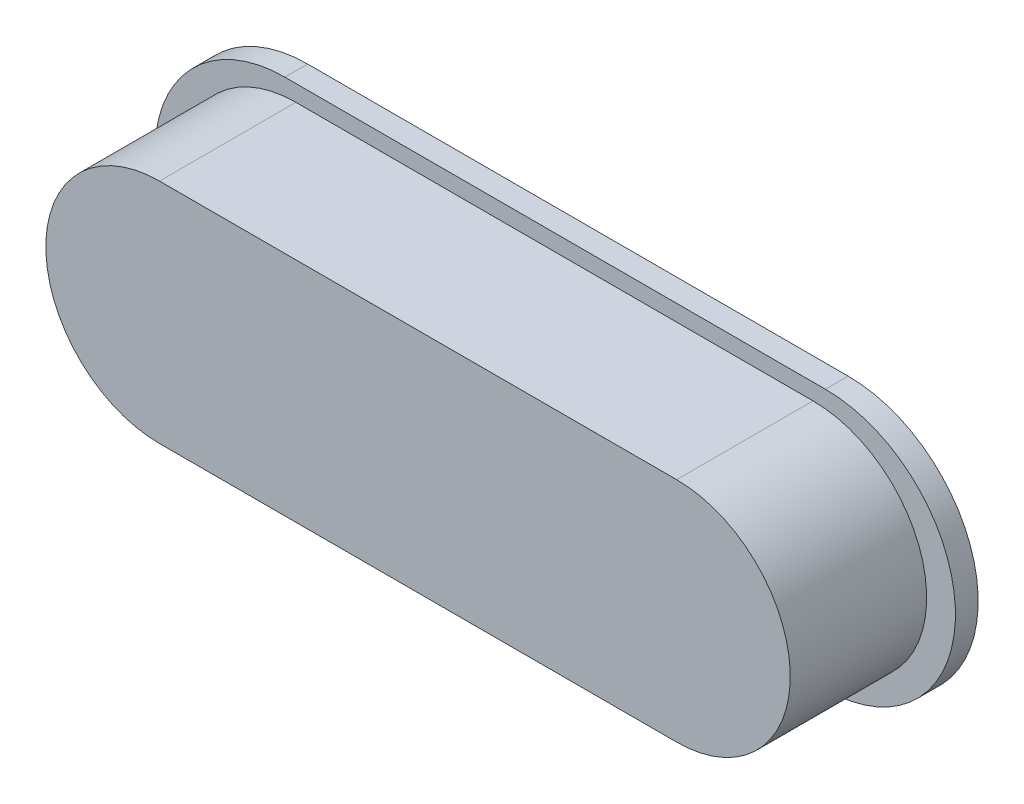
ISO-10303-21;
HEADER;
FILE_DESCRIPTION(('STEP AP214'),'2;1');
FILE_NAME('part.step','',(''),(''),'','','');
FILE_SCHEMA(('AUTOMOTIVE_DESIGN { 1 0 10303 214 1 1 1 1 }'));
ENDSEC;
DATA;
#1=APPLICATION_CONTEXT('core data for automotive mechanical design processes');
#2=APPLICATION_PROTOCOL_DEFINITION('international standard','automotive_design',2000,#1);
#3=PRODUCT_CONTEXT('',#1,'mechanical');
#4=PRODUCT('Part','Part','',(#3));
#5=PRODUCT_RELATED_PRODUCT_CATEGORY('part','',(#4));
#6=PRODUCT_DEFINITION_FORMATION('','',#4);
#7=PRODUCT_DEFINITION_CONTEXT('part definition',#1,'design');
#8=PRODUCT_DEFINITION('design','',#6,#7);
#9=PRODUCT_DEFINITION_SHAPE('','',#8);
#10=(LENGTH_UNIT() NAMED_UNIT(*) SI_UNIT(.MILLI.,.METRE.));
#11=(NAMED_UNIT(*) PLANE_ANGLE_UNIT() SI_UNIT($,.RADIAN.));
#12=(NAMED_UNIT(*) SI_UNIT($,.STERADIAN.) SOLID_ANGLE_UNIT());
#13=UNCERTAINTY_MEASURE_WITH_UNIT(LENGTH_MEASURE(1.E-05),#10,'distance_accuracy_value','');
#14=(GEOMETRIC_REPRESENTATION_CONTEXT(3) GLOBAL_UNCERTAINTY_ASSIGNED_CONTEXT((#13)) GLOBAL_UNIT_ASSIGNED_CONTEXT((#10,
#11,#12)) REPRESENTATION_CONTEXT('',''));
#15=CARTESIAN_POINT('',(0.,0.,0.));
#16=DIRECTION('',(0.,0.,1.));
#17=DIRECTION('',(1.,0.,0.));
#18=AXIS2_PLACEMENT_3D('',#15,#16,#17);
#19=CARTESIAN_POINT('',(-22.75,11.4348279403043,-1.99999999999999));
#20=DIRECTION('',(0.,1.,0.));
#21=DIRECTION('',(-1.,0.,0.));
#22=AXIS2_PLACEMENT_3D('',#19,#20,#21);
#23=PLANE('',#22);
#24=DIRECTION('',(-1.,0.,0.));
#25=VECTOR('',#24,1.);
#26=CARTESIAN_POINT('',(-22.75,11.4348279403043,0.));
#27=LINE('',#26,#25);
#28=CARTESIAN_POINT('',(23.8475102992996,11.4348279403043,0.));
#29=VERTEX_POINT('',#28);
#30=CARTESIAN_POINT('',(-23.7170580444005,11.4348279403043,0.));
#31=VERTEX_POINT('',#30);
#32=EDGE_CURVE('E145',#29,#31,#27,.T.);
#33=ORIENTED_EDGE('',*,*,#32,.F.);
#34=DIRECTION('',(0.,0.,1.));
#35=VECTOR('',#34,1.);
#36=CARTESIAN_POINT('',(23.8475102992996,11.4348279403043,-1.99999999999999));
#37=LINE('',#36,#35);
#38=CARTESIAN_POINT('',(23.8475102992996,11.4348279403043,-1.99999999999999));
#39=VERTEX_POINT('',#38);
#40=EDGE_CURVE('E12',#39,#29,#37,.T.);
#41=ORIENTED_EDGE('',*,*,#40,.F.);
#42=DIRECTION('',(-1.,0.,0.));
#43=VECTOR('',#42,1.);
#44=CARTESIAN_POINT('',(-22.75,11.4348279403043,-1.99999999999999));
#45=LINE('',#44,#43);
#46=CARTESIAN_POINT('',(-23.7170580444005,11.4348279403043,-1.99999999999999));
#47=VERTEX_POINT('',#46);
#48=EDGE_CURVE('E149',#39,#47,#45,.T.);
#49=ORIENTED_EDGE('',*,*,#48,.T.);
#50=DIRECTION('',(0.,0.,1.));
#51=VECTOR('',#50,1.);
#52=CARTESIAN_POINT('',(-23.7170580444005,11.4348279403043,-1.99999999999999));
#53=LINE('',#52,#51);
#54=EDGE_CURVE('E50',#47,#31,#53,.T.);
#55=ORIENTED_EDGE('',*,*,#54,.T.);
#56=EDGE_LOOP('',(#33,#41,#49,#55));
#57=FACE_BOUND('',#56,.T.);
#58=ADVANCED_FACE('F47',(#57),#23,.T.);
#59=CARTESIAN_POINT('',(23.8475102992996,0.,-1.99999999999999));
#60=DIRECTION('',(0.,0.,1.));
#61=DIRECTION('',(1.,0.,0.));
#62=AXIS2_PLACEMENT_3D('',#59,#60,#61);
#63=CYLINDRICAL_SURFACE('',#62,11.4348279403043);
#64=CARTESIAN_POINT('',(23.8475102992996,0.,0.));
#65=DIRECTION('',(0.,0.,1.));
#66=DIRECTION('',(1.,0.,0.));
#67=AXIS2_PLACEMENT_3D('',#64,#65,#66);
#68=CIRCLE('',#67,11.4348279403043);
#69=CARTESIAN_POINT('',(23.8475102992996,-11.4348279403043,0.));
#70=VERTEX_POINT('',#69);
#71=EDGE_CURVE('E153',#70,#29,#68,.T.);
#72=ORIENTED_EDGE('',*,*,#71,.F.);
#73=DIRECTION('',(0.,0.,1.));
#74=VECTOR('',#73,1.);
#75=CARTESIAN_POINT('',(23.8475102992996,-11.4348279403043,-1.99999999999999));
#76=LINE('',#75,#74);
#77=CARTESIAN_POINT('',(23.8475102992996,-11.4348279403043,-1.99999999999999));
#78=VERTEX_POINT('',#77);
#79=EDGE_CURVE('E55',#78,#70,#76,.T.);
#80=ORIENTED_EDGE('',*,*,#79,.F.);
#81=CARTESIAN_POINT('',(23.8475102992996,0.,-1.99999999999999));
#82=DIRECTION('',(0.,0.,1.));
#83=DIRECTION('',(1.,0.,0.));
#84=AXIS2_PLACEMENT_3D('',#81,#82,#83);
#85=CIRCLE('',#84,11.4348279403043);
#86=EDGE_CURVE('E159',#78,#39,#85,.T.);
#87=ORIENTED_EDGE('',*,*,#86,.T.);
#88=ORIENTED_EDGE('',*,*,#40,.T.);
#89=EDGE_LOOP('',(#72,#80,#87,#88));
#90=FACE_BOUND('',#89,.T.);
#91=ADVANCED_FACE('F185',(#90),#63,.T.);
#92=CARTESIAN_POINT('',(-22.75,-11.4348279403043,-1.99999999999999));
#93=DIRECTION('',(0.,-1.,0.));
#94=DIRECTION('',(1.,0.,0.));
#95=AXIS2_PLACEMENT_3D('',#92,#93,#94);
#96=PLANE('',#95);
#97=DIRECTION('',(1.,0.,0.));
#98=VECTOR('',#97,1.);
#99=CARTESIAN_POINT('',(-22.75,-11.4348279403043,0.));
#100=LINE('',#99,#98);
#101=CARTESIAN_POINT('',(-23.7170580444005,-11.4348279403043,0.));
#102=VERTEX_POINT('',#101);
#103=EDGE_CURVE('E167',#102,#70,#100,.T.);
#104=ORIENTED_EDGE('',*,*,#103,.F.);
#105=DIRECTION('',(0.,0.,1.));
#106=VECTOR('',#105,1.);
#107=CARTESIAN_POINT('',(-23.7170580444005,-11.4348279403043,-1.99999999999999));
#108=LINE('',#107,#106);
#109=CARTESIAN_POINT('',(-23.7170580444005,-11.4348279403043,-1.99999999999999));
#110=VERTEX_POINT('',#109);
#111=EDGE_CURVE('E172',#110,#102,#108,.T.);
#112=ORIENTED_EDGE('',*,*,#111,.F.);
#113=DIRECTION('',(1.,0.,0.));
#114=VECTOR('',#113,1.);
#115=CARTESIAN_POINT('',(-22.75,-11.4348279403043,-1.99999999999999));
#116=LINE('',#115,#114);
#117=EDGE_CURVE('E156',#110,#78,#116,.T.);
#118=ORIENTED_EDGE('',*,*,#117,.T.);
#119=ORIENTED_EDGE('',*,*,#79,.T.);
#120=EDGE_LOOP('',(#104,#112,#118,#119));
#121=FACE_BOUND('',#120,.T.);
#122=ADVANCED_FACE('F189',(#121),#96,.T.);
#123=CARTESIAN_POINT('',(-23.7170580444005,0.,-1.99999999999999));
#124=DIRECTION('',(0.,0.,1.));
#125=DIRECTION('',(1.,0.,0.));
#126=AXIS2_PLACEMENT_3D('',#123,#124,#125);
#127=CYLINDRICAL_SURFACE('',#126,11.4348279403043);
#128=CARTESIAN_POINT('',(-23.7170580444005,0.,0.));
#129=DIRECTION('',(0.,0.,1.));
#130=DIRECTION('',(1.,0.,0.));
#131=AXIS2_PLACEMENT_3D('',#128,#129,#130);
#132=CIRCLE('',#131,11.4348279403043);
#133=EDGE_CURVE('E164',#31,#102,#132,.T.);
#134=ORIENTED_EDGE('',*,*,#133,.F.);
#135=ORIENTED_EDGE('',*,*,#54,.F.);
#136=CARTESIAN_POINT('',(-23.7170580444005,0.,-1.99999999999999));
#137=DIRECTION('',(0.,0.,1.));
#138=DIRECTION('',(1.,0.,0.));
#139=AXIS2_PLACEMENT_3D('',#136,#137,#138);
#140=CIRCLE('',#139,11.4348279403043);
#141=EDGE_CURVE('E152',#47,#110,#140,.T.);
#142=ORIENTED_EDGE('',*,*,#141,.T.);
#143=ORIENTED_EDGE('',*,*,#111,.T.);
#144=EDGE_LOOP('',(#134,#135,#142,#143));
#145=FACE_BOUND('',#144,.T.);
#146=ADVANCED_FACE('F180',(#145),#127,.T.);
#147=CARTESIAN_POINT('',(-23.7170580444005,0.,-1.99999999999999));
#148=DIRECTION('',(0.,0.,1.));
#149=DIRECTION('',(1.,0.,0.));
#150=AXIS2_PLACEMENT_3D('',#147,#148,#149);
#151=PLANE('',#150);
#152=CARTESIAN_POINT('',(23.5,0.,-1.99999999999999));
#153=DIRECTION('',(0.,0.,1.));
#154=DIRECTION('',(1.,0.,0.));
#155=AXIS2_PLACEMENT_3D('',#152,#153,#154);
#156=CIRCLE('',#155,8.);
#157=CARTESIAN_POINT('',(23.5,-7.99999999999999,-1.99999999999999));
#158=VERTEX_POINT('',#157);
#159=CARTESIAN_POINT('',(23.5,8.00000000000001,-1.99999999999999));
#160=VERTEX_POINT('',#159);
#161=EDGE_CURVE('E120',#158,#160,#156,.T.);
#162=ORIENTED_EDGE('',*,*,#161,.T.);
#163=DIRECTION('',(-1.,0.,0.));
#164=VECTOR('',#163,1.);
#165=CARTESIAN_POINT('',(-22.75,8.,-1.99999999999999));
#166=LINE('',#165,#164);
#167=CARTESIAN_POINT('',(-22.75,8.,-1.99999999999999));
#168=VERTEX_POINT('',#167);
#169=EDGE_CURVE('E114',#160,#168,#166,.T.);
#170=ORIENTED_EDGE('',*,*,#169,.T.);
#171=CARTESIAN_POINT('',(-22.75,0.,-1.99999999999999));
#172=DIRECTION('',(0.,0.,1.));
#173=DIRECTION('',(1.,0.,0.));
#174=AXIS2_PLACEMENT_3D('',#171,#172,#173);
#175=CIRCLE('',#174,8.);
#176=CARTESIAN_POINT('',(-22.75,-8.,-1.99999999999999));
#177=VERTEX_POINT('',#176);
#178=EDGE_CURVE('E123',#168,#177,#175,.T.);
#179=ORIENTED_EDGE('',*,*,#178,.T.);
#180=DIRECTION('',(1.,0.,0.));
#181=VECTOR('',#180,1.);
#182=CARTESIAN_POINT('',(-22.75,-8.,-1.99999999999999));
#183=LINE('',#182,#181);
#184=EDGE_CURVE('E63',#177,#158,#183,.T.);
#185=ORIENTED_EDGE('',*,*,#184,.T.);
#186=EDGE_LOOP('',(#162,#170,#179,#185));
#187=FACE_BOUND('',#186,.T.);
#188=ORIENTED_EDGE('',*,*,#48,.F.);
#189=ORIENTED_EDGE('',*,*,#86,.F.);
#190=ORIENTED_EDGE('',*,*,#117,.F.);
#191=ORIENTED_EDGE('',*,*,#141,.F.);
#192=EDGE_LOOP('',(#188,#189,#190,#191));
#193=FACE_BOUND('',#192,.T.);
#194=ADVANCED_FACE('F127',(#187,#193),#151,.F.);
#195=CARTESIAN_POINT('',(-23.7170580444005,0.,0.));
#196=DIRECTION('',(0.,0.,1.));
#197=DIRECTION('',(1.,0.,0.));
#198=AXIS2_PLACEMENT_3D('',#195,#196,#197);
#199=PLANE('',#198);
#200=DIRECTION('',(-1.,0.,0.));
#201=VECTOR('',#200,1.);
#202=CARTESIAN_POINT('',(-22.75,8.,0.));
#203=LINE('',#202,#201);
#204=CARTESIAN_POINT('',(23.5,8.00000000000001,0.));
#205=VERTEX_POINT('',#204);
#206=CARTESIAN_POINT('',(-22.75,8.,0.));
#207=VERTEX_POINT('',#206);
#208=EDGE_CURVE('E71',#205,#207,#203,.T.);
#209=ORIENTED_EDGE('',*,*,#208,.F.);
#210=CARTESIAN_POINT('',(23.5,0.,0.));
#211=DIRECTION('',(0.,0.,1.));
#212=DIRECTION('',(1.,0.,0.));
#213=AXIS2_PLACEMENT_3D('',#210,#211,#212);
#214=CIRCLE('',#213,8.);
#215=CARTESIAN_POINT('',(23.5,-7.99999999999999,0.));
#216=VERTEX_POINT('',#215);
#217=EDGE_CURVE('E130',#216,#205,#214,.T.);
#218=ORIENTED_EDGE('',*,*,#217,.F.);
#219=DIRECTION('',(1.,0.,0.));
#220=VECTOR('',#219,1.);
#221=CARTESIAN_POINT('',(-22.75,-8.,0.));
#222=LINE('',#221,#220);
#223=CARTESIAN_POINT('',(-22.75,-8.,0.));
#224=VERTEX_POINT('',#223);
#225=EDGE_CURVE('E133',#224,#216,#222,.T.);
#226=ORIENTED_EDGE('',*,*,#225,.F.);
#227=CARTESIAN_POINT('',(-22.75,0.,0.));
#228=DIRECTION('',(0.,0.,1.));
#229=DIRECTION('',(1.,0.,0.));
#230=AXIS2_PLACEMENT_3D('',#227,#228,#229);
#231=CIRCLE('',#230,8.);
#232=EDGE_CURVE('E139',#207,#224,#231,.T.);
#233=ORIENTED_EDGE('',*,*,#232,.F.);
#234=EDGE_LOOP('',(#209,#218,#226,#233));
#235=FACE_BOUND('',#234,.T.);
#236=ORIENTED_EDGE('',*,*,#32,.T.);
#237=ORIENTED_EDGE('',*,*,#133,.T.);
#238=ORIENTED_EDGE('',*,*,#103,.T.);
#239=ORIENTED_EDGE('',*,*,#71,.T.);
#240=EDGE_LOOP('',(#236,#237,#238,#239));
#241=FACE_BOUND('',#240,.T.);
#242=ADVANCED_FACE('F182',(#235,#241),#199,.T.);
#243=CARTESIAN_POINT('',(-22.75,8.,-1.99999999999999));
#244=DIRECTION('',(0.,1.,0.));
#245=DIRECTION('',(0.,0.,1.));
#246=AXIS2_PLACEMENT_3D('',#243,#244,#245);
#247=PLANE('',#246);
#248=ORIENTED_EDGE('',*,*,#208,.T.);
#249=DIRECTION('',(0.,0.,1.));
#250=VECTOR('',#249,1.);
#251=CARTESIAN_POINT('',(-22.75,8.,-1.99999999999999));
#252=LINE('',#251,#250);
#253=EDGE_CURVE('E110',#168,#207,#252,.T.);
#254=ORIENTED_EDGE('',*,*,#253,.F.);
#255=ORIENTED_EDGE('',*,*,#169,.F.);
#256=DIRECTION('',(0.,0.,1.));
#257=VECTOR('',#256,1.);
#258=CARTESIAN_POINT('',(23.5,8.00000000000001,-1.99999999999999));
#259=LINE('',#258,#257);
#260=EDGE_CURVE('E143',#160,#205,#259,.T.);
#261=ORIENTED_EDGE('',*,*,#260,.T.);
#262=EDGE_LOOP('',(#248,#254,#255,#261));
#263=FACE_BOUND('',#262,.T.);
#264=ADVANCED_FACE('F112',(#263),#247,.F.);
#265=CARTESIAN_POINT('',(23.5,0.,-1.99999999999999));
#266=DIRECTION('',(0.,0.,1.));
#267=DIRECTION('',(1.,0.,0.));
#268=AXIS2_PLACEMENT_3D('',#265,#266,#267);
#269=CYLINDRICAL_SURFACE('',#268,8.);
#270=ORIENTED_EDGE('',*,*,#217,.T.);
#271=ORIENTED_EDGE('',*,*,#260,.F.);
#272=ORIENTED_EDGE('',*,*,#161,.F.);
#273=DIRECTION('',(0.,0.,1.));
#274=VECTOR('',#273,1.);
#275=CARTESIAN_POINT('',(23.5,-7.99999999999999,-1.99999999999999));
#276=LINE('',#275,#274);
#277=EDGE_CURVE('E146',#158,#216,#276,.T.);
#278=ORIENTED_EDGE('',*,*,#277,.T.);
#279=EDGE_LOOP('',(#270,#271,#272,#278));
#280=FACE_BOUND('',#279,.T.);
#281=ADVANCED_FACE('F240',(#280),#269,.F.);
#282=CARTESIAN_POINT('',(-22.75,-8.,-1.99999999999999));
#283=DIRECTION('',(0.,-1.,0.));
#284=DIRECTION('',(0.,0.,-1.));
#285=AXIS2_PLACEMENT_3D('',#282,#283,#284);
#286=PLANE('',#285);
#287=ORIENTED_EDGE('',*,*,#225,.T.);
#288=ORIENTED_EDGE('',*,*,#277,.F.);
#289=ORIENTED_EDGE('',*,*,#184,.F.);
#290=DIRECTION('',(0.,0.,1.));
#291=VECTOR('',#290,1.);
#292=CARTESIAN_POINT('',(-22.75,-8.,-1.99999999999999));
#293=LINE('',#292,#291);
#294=EDGE_CURVE('E119',#177,#224,#293,.T.);
#295=ORIENTED_EDGE('',*,*,#294,.T.);
#296=EDGE_LOOP('',(#287,#288,#289,#295));
#297=FACE_BOUND('',#296,.T.);
#298=ADVANCED_FACE('F249',(#297),#286,.F.);
#299=CARTESIAN_POINT('',(-22.75,0.,-1.99999999999999));
#300=DIRECTION('',(0.,0.,1.));
#301=DIRECTION('',(1.,0.,0.));
#302=AXIS2_PLACEMENT_3D('',#299,#300,#301);
#303=CYLINDRICAL_SURFACE('',#302,8.);
#304=ORIENTED_EDGE('',*,*,#232,.T.);
#305=ORIENTED_EDGE('',*,*,#294,.F.);
#306=ORIENTED_EDGE('',*,*,#178,.F.);
#307=ORIENTED_EDGE('',*,*,#253,.T.);
#308=EDGE_LOOP('',(#304,#305,#306,#307));
#309=FACE_BOUND('',#308,.T.);
#310=ADVANCED_FACE('F124',(#309),#303,.F.);
#311=CLOSED_SHELL('',(#58,#91,#122,#146,#194,#242,#264,#281,#298,#310));
#312=MANIFOLD_SOLID_BREP('B2',#311);
#313=CARTESIAN_POINT('',(-22.75,0.,0.));
#314=DIRECTION('',(0.,0.,1.));
#315=DIRECTION('',(1.,0.,0.));
#316=AXIS2_PLACEMENT_3D('',#313,#314,#315);
#317=PLANE('',#316);
#318=CARTESIAN_POINT('',(-22.75,0.,0.));
#319=DIRECTION('',(0.,0.,1.));
#320=DIRECTION('',(1.,0.,0.));
#321=AXIS2_PLACEMENT_3D('',#318,#319,#320);
#322=CIRCLE('',#321,10.);
#323=CARTESIAN_POINT('',(-22.75,10.,0.));
#324=VERTEX_POINT('',#323);
#325=CARTESIAN_POINT('',(-22.75,-10.,0.));
#326=VERTEX_POINT('',#325);
#327=EDGE_CURVE('E371',#324,#326,#322,.T.);
#328=ORIENTED_EDGE('',*,*,#327,.F.);
#329=DIRECTION('',(-1.,0.,0.));
#330=VECTOR('',#329,1.);
#331=CARTESIAN_POINT('',(-22.75,10.,0.));
#332=LINE('',#331,#330);
#333=CARTESIAN_POINT('',(22.75,10.,0.));
#334=VERTEX_POINT('',#333);
#335=EDGE_CURVE('E322',#334,#324,#332,.T.);
#336=ORIENTED_EDGE('',*,*,#335,.F.);
#337=CARTESIAN_POINT('',(22.75,0.,0.));
#338=DIRECTION('',(0.,0.,1.));
#339=DIRECTION('',(1.,0.,0.));
#340=AXIS2_PLACEMENT_3D('',#337,#338,#339);
#341=CIRCLE('',#340,10.);
#342=CARTESIAN_POINT('',(22.75,-10.,0.));
#343=VERTEX_POINT('',#342);
#344=EDGE_CURVE('E389',#343,#334,#341,.T.);
#345=ORIENTED_EDGE('',*,*,#344,.F.);
#346=DIRECTION('',(1.,0.,0.));
#347=VECTOR('',#346,1.);
#348=CARTESIAN_POINT('',(-22.75,-10.,0.));
#349=LINE('',#348,#347);
#350=EDGE_CURVE('E375',#326,#343,#349,.T.);
#351=ORIENTED_EDGE('',*,*,#350,.F.);
#352=EDGE_LOOP('',(#328,#336,#345,#351));
#353=FACE_BOUND('',#352,.T.);
#354=CARTESIAN_POINT('',(-23.5,0.,0.));
#355=DIRECTION('',(0.,0.,1.));
#356=DIRECTION('',(1.,0.,0.));
#357=AXIS2_PLACEMENT_3D('',#354,#355,#356);
#358=CIRCLE('',#357,8.);
#359=CARTESIAN_POINT('',(-23.5,8.,0.));
#360=VERTEX_POINT('',#359);
#361=CARTESIAN_POINT('',(-23.5,-8.,0.));
#362=VERTEX_POINT('',#361);
#363=EDGE_CURVE('E292',#360,#362,#358,.T.);
#364=ORIENTED_EDGE('',*,*,#363,.T.);
#365=DIRECTION('',(1.,0.,0.));
#366=VECTOR('',#365,1.);
#367=CARTESIAN_POINT('',(-23.5,-8.,0.));
#368=LINE('',#367,#366);
#369=CARTESIAN_POINT('',(23.5,-8.,0.));
#370=VERTEX_POINT('',#369);
#371=EDGE_CURVE('E370',#362,#370,#368,.T.);
#372=ORIENTED_EDGE('',*,*,#371,.T.);
#373=CARTESIAN_POINT('',(23.5,0.,0.));
#374=DIRECTION('',(0.,0.,1.));
#375=DIRECTION('',(1.,0.,0.));
#376=AXIS2_PLACEMENT_3D('',#373,#374,#375);
#377=CIRCLE('',#376,8.);
#378=CARTESIAN_POINT('',(23.5,8.,0.));
#379=VERTEX_POINT('',#378);
#380=EDGE_CURVE('E503',#370,#379,#377,.T.);
#381=ORIENTED_EDGE('',*,*,#380,.T.);
#382=DIRECTION('',(-1.,0.,0.));
#383=VECTOR('',#382,1.);
#384=CARTESIAN_POINT('',(-23.5,8.,0.));
#385=LINE('',#384,#383);
#386=EDGE_CURVE('E366',#379,#360,#385,.T.);
#387=ORIENTED_EDGE('',*,*,#386,.T.);
#388=EDGE_LOOP('',(#364,#372,#381,#387));
#389=FACE_BOUND('',#388,.T.);
#390=ADVANCED_FACE('F277',(#353,#389),#317,.F.);
#391=CARTESIAN_POINT('',(-22.75,0.,12.));
#392=DIRECTION('',(0.,0.,-1.));
#393=DIRECTION('',(-1.,0.,0.));
#394=AXIS2_PLACEMENT_3D('',#391,#392,#393);
#395=CYLINDRICAL_SURFACE('',#394,10.);
#396=ORIENTED_EDGE('',*,*,#327,.T.);
#397=DIRECTION('',(0.,0.,-1.));
#398=VECTOR('',#397,1.);
#399=CARTESIAN_POINT('',(-22.75,-10.,12.));
#400=LINE('',#399,#398);
#401=CARTESIAN_POINT('',(-22.75,-10.,12.));
#402=VERTEX_POINT('',#401);
#403=EDGE_CURVE('E45',#402,#326,#400,.T.);
#404=ORIENTED_EDGE('',*,*,#403,.F.);
#405=CARTESIAN_POINT('',(-22.75,0.,12.));
#406=DIRECTION('',(0.,0.,1.));
#407=DIRECTION('',(1.,0.,0.));
#408=AXIS2_PLACEMENT_3D('',#405,#406,#407);
#409=CIRCLE('',#408,10.);
#410=CARTESIAN_POINT('',(-22.75,10.,12.));
#411=VERTEX_POINT('',#410);
#412=EDGE_CURVE('E381',#411,#402,#409,.T.);
#413=ORIENTED_EDGE('',*,*,#412,.F.);
#414=DIRECTION('',(0.,0.,-1.));
#415=VECTOR('',#414,1.);
#416=CARTESIAN_POINT('',(-22.75,10.,12.));
#417=LINE('',#416,#415);
#418=EDGE_CURVE('E386',#411,#324,#417,.T.);
#419=ORIENTED_EDGE('',*,*,#418,.T.);
#420=EDGE_LOOP('',(#396,#404,#413,#419));
#421=FACE_BOUND('',#420,.T.);
#422=ADVANCED_FACE('F279',(#421),#395,.T.);
#423=CARTESIAN_POINT('',(-22.75,-10.,12.));
#424=DIRECTION('',(0.,1.,0.));
#425=DIRECTION('',(0.,0.,1.));
#426=AXIS2_PLACEMENT_3D('',#423,#424,#425);
#427=PLANE('',#426);
#428=ORIENTED_EDGE('',*,*,#350,.T.);
#429=DIRECTION('',(0.,0.,-1.));
#430=VECTOR('',#429,1.);
#431=CARTESIAN_POINT('',(22.75,-10.,12.));
#432=LINE('',#431,#430);
#433=CARTESIAN_POINT('',(22.75,-10.,12.));
#434=VERTEX_POINT('',#433);
#435=EDGE_CURVE('E285',#434,#343,#432,.T.);
#436=ORIENTED_EDGE('',*,*,#435,.F.);
#437=DIRECTION('',(1.,0.,0.));
#438=VECTOR('',#437,1.);
#439=CARTESIAN_POINT('',(-22.75,-10.,12.));
#440=LINE('',#439,#438);
#441=EDGE_CURVE('E329',#402,#434,#440,.T.);
#442=ORIENTED_EDGE('',*,*,#441,.F.);
#443=ORIENTED_EDGE('',*,*,#403,.T.);
#444=EDGE_LOOP('',(#428,#436,#442,#443));
#445=FACE_BOUND('',#444,.T.);
#446=ADVANCED_FACE('F415',(#445),#427,.F.);
#447=CARTESIAN_POINT('',(22.75,0.,12.));
#448=DIRECTION('',(0.,0.,-1.));
#449=DIRECTION('',(-1.,0.,0.));
#450=AXIS2_PLACEMENT_3D('',#447,#448,#449);
#451=CYLINDRICAL_SURFACE('',#450,10.);
#452=ORIENTED_EDGE('',*,*,#344,.T.);
#453=DIRECTION('',(0.,0.,-1.));
#454=VECTOR('',#453,1.);
#455=CARTESIAN_POINT('',(22.75,10.,12.));
#456=LINE('',#455,#454);
#457=CARTESIAN_POINT('',(22.75,10.,12.));
#458=VERTEX_POINT('',#457);
#459=EDGE_CURVE('E393',#458,#334,#456,.T.);
#460=ORIENTED_EDGE('',*,*,#459,.F.);
#461=CARTESIAN_POINT('',(22.75,0.,12.));
#462=DIRECTION('',(0.,0.,1.));
#463=DIRECTION('',(1.,0.,0.));
#464=AXIS2_PLACEMENT_3D('',#461,#462,#463);
#465=CIRCLE('',#464,10.);
#466=EDGE_CURVE('E384',#434,#458,#465,.T.);
#467=ORIENTED_EDGE('',*,*,#466,.F.);
#468=ORIENTED_EDGE('',*,*,#435,.T.);
#469=EDGE_LOOP('',(#452,#460,#467,#468));
#470=FACE_BOUND('',#469,.T.);
#471=ADVANCED_FACE('F398',(#470),#451,.T.);
#472=CARTESIAN_POINT('',(-22.75,10.,12.));
#473=DIRECTION('',(0.,-1.,0.));
#474=DIRECTION('',(0.,0.,-1.));
#475=AXIS2_PLACEMENT_3D('',#472,#473,#474);
#476=PLANE('',#475);
#477=ORIENTED_EDGE('',*,*,#335,.T.);
#478=ORIENTED_EDGE('',*,*,#418,.F.);
#479=DIRECTION('',(-1.,0.,0.));
#480=VECTOR('',#479,1.);
#481=CARTESIAN_POINT('',(-22.75,10.,12.));
#482=LINE('',#481,#480);
#483=EDGE_CURVE('E301',#458,#411,#482,.T.);
#484=ORIENTED_EDGE('',*,*,#483,.F.);
#485=ORIENTED_EDGE('',*,*,#459,.T.);
#486=EDGE_LOOP('',(#477,#478,#484,#485));
#487=FACE_BOUND('',#486,.T.);
#488=ADVANCED_FACE('F406',(#487),#476,.F.);
#489=CARTESIAN_POINT('',(-22.75,0.,12.));
#490=DIRECTION('',(0.,0.,1.));
#491=DIRECTION('',(1.,0.,0.));
#492=AXIS2_PLACEMENT_3D('',#489,#490,#491);
#493=PLANE('',#492);
#494=ORIENTED_EDGE('',*,*,#412,.T.);
#495=ORIENTED_EDGE('',*,*,#441,.T.);
#496=ORIENTED_EDGE('',*,*,#466,.T.);
#497=ORIENTED_EDGE('',*,*,#483,.T.);
#498=EDGE_LOOP('',(#494,#495,#496,#497));
#499=FACE_BOUND('',#498,.T.);
#500=ADVANCED_FACE('F408',(#499),#493,.T.);
#501=CARTESIAN_POINT('',(-23.5,0.,7.99999999999999));
#502=DIRECTION('',(0.,0.,-1.));
#503=DIRECTION('',(-1.,0.,0.));
#504=AXIS2_PLACEMENT_3D('',#501,#502,#503);
#505=CYLINDRICAL_SURFACE('',#504,8.);
#506=ORIENTED_EDGE('',*,*,#363,.F.);
#507=DIRECTION('',(0.,0.,-1.));
#508=VECTOR('',#507,1.);
#509=CARTESIAN_POINT('',(-23.5,8.,7.99999999999999));
#510=LINE('',#509,#508);
#511=CARTESIAN_POINT('',(-23.5,8.,7.99999999999999));
#512=VERTEX_POINT('',#511);
#513=EDGE_CURVE('E365',#512,#360,#510,.T.);
#514=ORIENTED_EDGE('',*,*,#513,.F.);
#515=CARTESIAN_POINT('',(-23.5,0.,7.99999999999999));
#516=DIRECTION('',(0.,0.,1.));
#517=DIRECTION('',(1.,0.,0.));
#518=AXIS2_PLACEMENT_3D('',#515,#516,#517);
#519=CIRCLE('',#518,8.);
#520=CARTESIAN_POINT('',(-23.5,-8.,7.99999999999999));
#521=VERTEX_POINT('',#520);
#522=EDGE_CURVE('E357',#512,#521,#519,.T.);
#523=ORIENTED_EDGE('',*,*,#522,.T.);
#524=DIRECTION('',(0.,0.,-1.));
#525=VECTOR('',#524,1.);
#526=CARTESIAN_POINT('',(-23.5,-8.,7.99999999999999));
#527=LINE('',#526,#525);
#528=EDGE_CURVE('E364',#521,#362,#527,.T.);
#529=ORIENTED_EDGE('',*,*,#528,.T.);
#530=EDGE_LOOP('',(#506,#514,#523,#529));
#531=FACE_BOUND('',#530,.T.);
#532=ADVANCED_FACE('F363',(#531),#505,.F.);
#533=CARTESIAN_POINT('',(-23.5,-8.,7.99999999999999));
#534=DIRECTION('',(0.,1.,0.));
#535=DIRECTION('',(0.,0.,1.));
#536=AXIS2_PLACEMENT_3D('',#533,#534,#535);
#537=PLANE('',#536);
#538=ORIENTED_EDGE('',*,*,#371,.F.);
#539=ORIENTED_EDGE('',*,*,#528,.F.);
#540=DIRECTION('',(1.,0.,0.));
#541=VECTOR('',#540,1.);
#542=CARTESIAN_POINT('',(-23.5,-8.,7.99999999999999));
#543=LINE('',#542,#541);
#544=CARTESIAN_POINT('',(23.5,-8.,7.99999999999999));
#545=VERTEX_POINT('',#544);
#546=EDGE_CURVE('E353',#521,#545,#543,.T.);
#547=ORIENTED_EDGE('',*,*,#546,.T.);
#548=DIRECTION('',(0.,0.,-1.));
#549=VECTOR('',#548,1.);
#550=CARTESIAN_POINT('',(23.5,-8.,7.99999999999999));
#551=LINE('',#550,#549);
#552=EDGE_CURVE('E372',#545,#370,#551,.T.);
#553=ORIENTED_EDGE('',*,*,#552,.T.);
#554=EDGE_LOOP('',(#538,#539,#547,#553));
#555=FACE_BOUND('',#554,.T.);
#556=ADVANCED_FACE('F368',(#555),#537,.T.);
#557=CARTESIAN_POINT('',(23.5,0.,7.99999999999999));
#558=DIRECTION('',(0.,0.,-1.));
#559=DIRECTION('',(-1.,0.,0.));
#560=AXIS2_PLACEMENT_3D('',#557,#558,#559);
#561=CYLINDRICAL_SURFACE('',#560,8.);
#562=ORIENTED_EDGE('',*,*,#380,.F.);
#563=ORIENTED_EDGE('',*,*,#552,.F.);
#564=CARTESIAN_POINT('',(23.5,0.,7.99999999999999));
#565=DIRECTION('',(0.,0.,1.));
#566=DIRECTION('',(1.,0.,0.));
#567=AXIS2_PLACEMENT_3D('',#564,#565,#566);
#568=CIRCLE('',#567,8.);
#569=CARTESIAN_POINT('',(23.5,8.,7.99999999999999));
#570=VERTEX_POINT('',#569);
#571=EDGE_CURVE('E358',#545,#570,#568,.T.);
#572=ORIENTED_EDGE('',*,*,#571,.T.);
#573=DIRECTION('',(0.,0.,-1.));
#574=VECTOR('',#573,1.);
#575=CARTESIAN_POINT('',(23.5,8.,7.99999999999999));
#576=LINE('',#575,#574);
#577=EDGE_CURVE('E377',#570,#379,#576,.T.);
#578=ORIENTED_EDGE('',*,*,#577,.T.);
#579=EDGE_LOOP('',(#562,#563,#572,#578));
#580=FACE_BOUND('',#579,.T.);
#581=ADVANCED_FACE('F427',(#580),#561,.F.);
#582=CARTESIAN_POINT('',(-23.5,8.,7.99999999999999));
#583=DIRECTION('',(0.,-1.,0.));
#584=DIRECTION('',(0.,0.,-1.));
#585=AXIS2_PLACEMENT_3D('',#582,#583,#584);
#586=PLANE('',#585);
#587=ORIENTED_EDGE('',*,*,#386,.F.);
#588=ORIENTED_EDGE('',*,*,#577,.F.);
#589=DIRECTION('',(-1.,0.,0.));
#590=VECTOR('',#589,1.);
#591=CARTESIAN_POINT('',(-23.5,8.,7.99999999999999));
#592=LINE('',#591,#590);
#593=EDGE_CURVE('E510',#570,#512,#592,.T.);
#594=ORIENTED_EDGE('',*,*,#593,.T.);
#595=ORIENTED_EDGE('',*,*,#513,.T.);
#596=EDGE_LOOP('',(#587,#588,#594,#595));
#597=FACE_BOUND('',#596,.T.);
#598=ADVANCED_FACE('F430',(#597),#586,.T.);
#599=CARTESIAN_POINT('',(-23.5,0.,7.99999999999999));
#600=DIRECTION('',(0.,0.,1.));
#601=DIRECTION('',(1.,0.,0.));
#602=AXIS2_PLACEMENT_3D('',#599,#600,#601);
#603=PLANE('',#602);
#604=ORIENTED_EDGE('',*,*,#522,.F.);
#605=ORIENTED_EDGE('',*,*,#593,.F.);
#606=ORIENTED_EDGE('',*,*,#571,.F.);
#607=ORIENTED_EDGE('',*,*,#546,.F.);
#608=EDGE_LOOP('',(#604,#605,#606,#607));
#609=FACE_BOUND('',#608,.T.);
#610=ADVANCED_FACE('F355',(#609),#603,.F.);
#611=CLOSED_SHELL('',(#390,#422,#446,#471,#488,#500,#532,#556,#581,#598,#610));
#612=MANIFOLD_SOLID_BREP('B6',#611);
#613=ADVANCED_BREP_SHAPE_REPRESENTATION('',(#18,#312,#612),#14);
#614=SHAPE_DEFINITION_REPRESENTATION(#9,#613);
ENDSEC;
END-ISO-10303-21;
